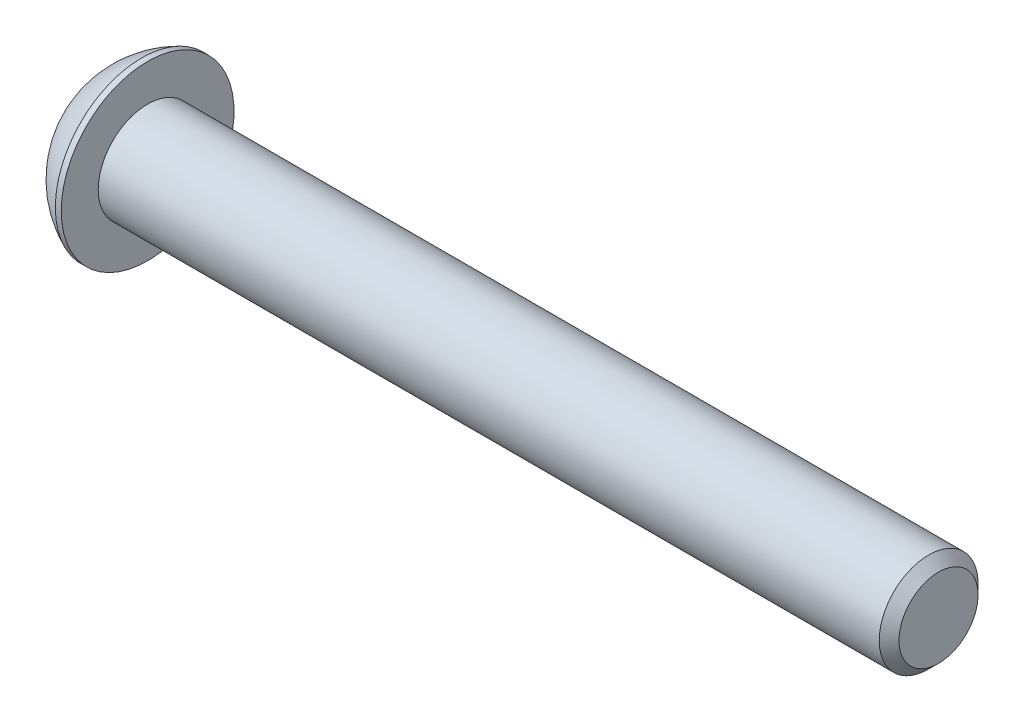
ISO-10303-21;
HEADER;
FILE_DESCRIPTION(('STEP AP214'),'2;1');
FILE_NAME('part.step','',(''),(''),'','','');
FILE_SCHEMA(('AUTOMOTIVE_DESIGN { 1 0 10303 214 1 1 1 1 }'));
ENDSEC;
DATA;
#1=APPLICATION_CONTEXT('core data for automotive mechanical design processes');
#2=APPLICATION_PROTOCOL_DEFINITION('international standard','automotive_design',2000,#1);
#3=PRODUCT_CONTEXT('',#1,'mechanical');
#4=PRODUCT('Part','Part','',(#3));
#5=PRODUCT_RELATED_PRODUCT_CATEGORY('part','',(#4));
#6=PRODUCT_DEFINITION_FORMATION('','',#4);
#7=PRODUCT_DEFINITION_CONTEXT('part definition',#1,'design');
#8=PRODUCT_DEFINITION('design','',#6,#7);
#9=PRODUCT_DEFINITION_SHAPE('','',#8);
#10=(LENGTH_UNIT() NAMED_UNIT(*) SI_UNIT(.MILLI.,.METRE.));
#11=(NAMED_UNIT(*) PLANE_ANGLE_UNIT() SI_UNIT($,.RADIAN.));
#12=(NAMED_UNIT(*) SI_UNIT($,.STERADIAN.) SOLID_ANGLE_UNIT());
#13=UNCERTAINTY_MEASURE_WITH_UNIT(LENGTH_MEASURE(1.E-05),#10,'distance_accuracy_value','');
#14=(GEOMETRIC_REPRESENTATION_CONTEXT(3) GLOBAL_UNCERTAINTY_ASSIGNED_CONTEXT((#13)) GLOBAL_UNIT_ASSIGNED_CONTEXT((#10,
#11,#12)) REPRESENTATION_CONTEXT('',''));
#15=CARTESIAN_POINT('',(0.,0.,0.));
#16=DIRECTION('',(0.,0.,1.));
#17=DIRECTION('',(1.,0.,0.));
#18=AXIS2_PLACEMENT_3D('',#15,#16,#17);
#19=CARTESIAN_POINT('',(1.32080000000034,0.,0.));
#20=DIRECTION('',(-1.,0.,0.));
#21=DIRECTION('',(0.,0.,1.));
#22=AXIS2_PLACEMENT_3D('',#19,#20,#21);
#23=CONICAL_SURFACE('',#22,1.1937999999998,1.04719755119608);
#24=CARTESIAN_POINT('',(2.01004075135902,0.,-4.44089209850063E-13));
#25=VERTEX_POINT('',#24);
#26=VERTEX_LOOP('',#25);
#27=FACE_BOUND('',#26,.T.);
#28=CARTESIAN_POINT('',(1.32080000000009,0.,0.));
#29=DIRECTION('',(-1.,0.,0.));
#30=DIRECTION('',(0.,0.,1.));
#31=AXIS2_PLACEMENT_3D('',#28,#29,#30);
#32=CIRCLE('',#31,1.19380000000024);
#33=CARTESIAN_POINT('',(1.32080000000009,0.,1.19380000000024));
#34=VERTEX_POINT('',#33);
#35=EDGE_CURVE('E18',#34,#34,#32,.T.);
#36=ORIENTED_EDGE('',*,*,#35,.T.);
#37=EDGE_LOOP('',(#36));
#38=FACE_BOUND('',#37,.T.);
#39=ADVANCED_FACE('F15',(#27,#38),#23,.F.);
#40=CARTESIAN_POINT('',(1.3208,-2.29135888084633,0.));
#41=DIRECTION('',(1.,0.,0.));
#42=DIRECTION('',(0.,0.,-1.));
#43=AXIS2_PLACEMENT_3D('',#40,#41,#42);
#44=PLANE('',#43);
#45=DIRECTION('',(0.,1.,0.));
#46=VECTOR('',#45,1.);
#47=CARTESIAN_POINT('',(1.3208,-1.14567944042316,1.984375));
#48=LINE('',#47,#46);
#49=CARTESIAN_POINT('',(1.3208,1.14567944042316,1.984375));
#50=VERTEX_POINT('',#49);
#51=CARTESIAN_POINT('',(1.3208,-1.14567944042316,1.984375));
#52=VERTEX_POINT('',#51);
#53=EDGE_CURVE('E67',#50,#52,#48,.F.);
#54=ORIENTED_EDGE('',*,*,#53,.F.);
#55=DIRECTION('',(0.,0.5,-0.866025403784439));
#56=VECTOR('',#55,1.);
#57=CARTESIAN_POINT('',(1.3208,1.14567944042316,1.984375));
#58=LINE('',#57,#56);
#59=CARTESIAN_POINT('',(1.3208,2.29135888084633,0.));
#60=VERTEX_POINT('',#59);
#61=EDGE_CURVE('E290',#60,#50,#58,.F.);
#62=ORIENTED_EDGE('',*,*,#61,.F.);
#63=DIRECTION('',(0.,-0.5,-0.866025403784439));
#64=VECTOR('',#63,1.);
#65=CARTESIAN_POINT('',(1.3208,2.29135888084633,0.));
#66=LINE('',#65,#64);
#67=CARTESIAN_POINT('',(1.3208,1.14567944042316,-1.984375));
#68=VERTEX_POINT('',#67);
#69=EDGE_CURVE('E294',#68,#60,#66,.F.);
#70=ORIENTED_EDGE('',*,*,#69,.F.);
#71=DIRECTION('',(0.,1.,0.));
#72=VECTOR('',#71,1.);
#73=CARTESIAN_POINT('',(1.3208,1.14567944042316,-1.984375));
#74=LINE('',#73,#72);
#75=CARTESIAN_POINT('',(1.3208,-1.14567944042316,-1.984375));
#76=VERTEX_POINT('',#75);
#77=EDGE_CURVE('E299',#76,#68,#74,.T.);
#78=ORIENTED_EDGE('',*,*,#77,.F.);
#79=DIRECTION('',(0.,-0.500000000000001,0.866025403784438));
#80=VECTOR('',#79,1.);
#81=CARTESIAN_POINT('',(1.3208,-1.14567944042316,-1.984375));
#82=LINE('',#81,#80);
#83=CARTESIAN_POINT('',(1.3208,-2.29135888084633,0.));
#84=VERTEX_POINT('',#83);
#85=EDGE_CURVE('E304',#84,#76,#82,.F.);
#86=ORIENTED_EDGE('',*,*,#85,.F.);
#87=DIRECTION('',(0.,0.500000000000001,0.866025403784438));
#88=VECTOR('',#87,1.);
#89=CARTESIAN_POINT('',(1.3208,-2.29135888084633,0.));
#90=LINE('',#89,#88);
#91=EDGE_CURVE('E80',#52,#84,#90,.F.);
#92=ORIENTED_EDGE('',*,*,#91,.F.);
#93=EDGE_LOOP('',(#54,#62,#70,#78,#86,#92));
#94=FACE_BOUND('',#93,.T.);
#95=ORIENTED_EDGE('',*,*,#35,.F.);
#96=EDGE_LOOP('',(#95));
#97=FACE_BOUND('',#96,.T.);
#98=ADVANCED_FACE('F73',(#94,#97),#44,.F.);
#99=CARTESIAN_POINT('',(1.3208,-1.14567944042316,1.984375));
#100=DIRECTION('',(0.,0.,-1.));
#101=DIRECTION('',(0.,1.,0.));
#102=AXIS2_PLACEMENT_3D('',#99,#100,#101);
#103=PLANE('',#102);
#104=ORIENTED_EDGE('',*,*,#53,.T.);
#105=DIRECTION('',(1.,0.,0.));
#106=VECTOR('',#105,1.);
#107=CARTESIAN_POINT('',(1.3208,-1.14567944042316,1.984375));
#108=LINE('',#107,#106);
#109=CARTESIAN_POINT('',(0.,-1.14567944042316,1.984375));
#110=VERTEX_POINT('',#109);
#111=EDGE_CURVE('E77',#110,#52,#108,.T.);
#112=ORIENTED_EDGE('',*,*,#111,.F.);
#113=DIRECTION('',(0.,1.,0.));
#114=VECTOR('',#113,1.);
#115=CARTESIAN_POINT('',(0.,0.,1.984375));
#116=LINE('',#115,#114);
#117=CARTESIAN_POINT('',(0.,1.14567944042316,1.984375));
#118=VERTEX_POINT('',#117);
#119=EDGE_CURVE('E284',#118,#110,#116,.F.);
#120=ORIENTED_EDGE('',*,*,#119,.F.);
#121=DIRECTION('',(1.,0.,0.));
#122=VECTOR('',#121,1.);
#123=CARTESIAN_POINT('',(1.3208,1.14567944042316,1.984375));
#124=LINE('',#123,#122);
#125=EDGE_CURVE('E287',#50,#118,#124,.F.);
#126=ORIENTED_EDGE('',*,*,#125,.F.);
#127=EDGE_LOOP('',(#104,#112,#120,#126));
#128=FACE_BOUND('',#127,.T.);
#129=ADVANCED_FACE('F126',(#128),#103,.T.);
#130=CARTESIAN_POINT('',(1.3208,-2.29135888084633,0.));
#131=DIRECTION('',(0.,0.866025403784438,-0.500000000000001));
#132=DIRECTION('',(0.,0.500000000000001,0.866025403784438));
#133=AXIS2_PLACEMENT_3D('',#130,#131,#132);
#134=PLANE('',#133);
#135=ORIENTED_EDGE('',*,*,#91,.T.);
#136=DIRECTION('',(1.,0.,0.));
#137=VECTOR('',#136,1.);
#138=CARTESIAN_POINT('',(1.3208,-2.29135888084633,0.));
#139=LINE('',#138,#137);
#140=CARTESIAN_POINT('',(0.,-2.29135888084633,0.));
#141=VERTEX_POINT('',#140);
#142=EDGE_CURVE('E306',#141,#84,#139,.T.);
#143=ORIENTED_EDGE('',*,*,#142,.F.);
#144=DIRECTION('',(0.,-0.500000000000001,-0.866025403784438));
#145=VECTOR('',#144,1.);
#146=CARTESIAN_POINT('',(0.,-1.14567944042316,1.984375));
#147=LINE('',#146,#145);
#148=EDGE_CURVE('E281',#110,#141,#147,.T.);
#149=ORIENTED_EDGE('',*,*,#148,.F.);
#150=ORIENTED_EDGE('',*,*,#111,.T.);
#151=EDGE_LOOP('',(#135,#143,#149,#150));
#152=FACE_BOUND('',#151,.T.);
#153=ADVANCED_FACE('F122',(#152),#134,.T.);
#154=CARTESIAN_POINT('',(1.3208,-1.14567944042316,-1.984375));
#155=DIRECTION('',(0.,0.866025403784438,0.500000000000001));
#156=DIRECTION('',(0.,-0.500000000000001,0.866025403784438));
#157=AXIS2_PLACEMENT_3D('',#154,#155,#156);
#158=PLANE('',#157);
#159=ORIENTED_EDGE('',*,*,#85,.T.);
#160=DIRECTION('',(1.,0.,0.));
#161=VECTOR('',#160,1.);
#162=CARTESIAN_POINT('',(1.3208,-1.14567944042316,-1.984375));
#163=LINE('',#162,#161);
#164=CARTESIAN_POINT('',(0.,-1.14567944042316,-1.984375));
#165=VERTEX_POINT('',#164);
#166=EDGE_CURVE('E301',#165,#76,#163,.T.);
#167=ORIENTED_EDGE('',*,*,#166,.F.);
#168=DIRECTION('',(0.,0.500000000000001,-0.866025403784438));
#169=VECTOR('',#168,1.);
#170=CARTESIAN_POINT('',(0.,-2.29135888084633,0.));
#171=LINE('',#170,#169);
#172=EDGE_CURVE('E278',#141,#165,#171,.T.);
#173=ORIENTED_EDGE('',*,*,#172,.F.);
#174=ORIENTED_EDGE('',*,*,#142,.T.);
#175=EDGE_LOOP('',(#159,#167,#173,#174));
#176=FACE_BOUND('',#175,.T.);
#177=ADVANCED_FACE('F118',(#176),#158,.T.);
#178=CARTESIAN_POINT('',(1.3208,1.14567944042316,-1.984375));
#179=DIRECTION('',(0.,0.,1.));
#180=DIRECTION('',(1.,0.,0.));
#181=AXIS2_PLACEMENT_3D('',#178,#179,#180);
#182=PLANE('',#181);
#183=ORIENTED_EDGE('',*,*,#77,.T.);
#184=DIRECTION('',(1.,0.,0.));
#185=VECTOR('',#184,1.);
#186=CARTESIAN_POINT('',(1.3208,1.14567944042316,-1.984375));
#187=LINE('',#186,#185);
#188=CARTESIAN_POINT('',(0.,1.14567944042316,-1.984375));
#189=VERTEX_POINT('',#188);
#190=EDGE_CURVE('E296',#189,#68,#187,.T.);
#191=ORIENTED_EDGE('',*,*,#190,.F.);
#192=DIRECTION('',(0.,1.,0.));
#193=VECTOR('',#192,1.);
#194=CARTESIAN_POINT('',(0.,0.,-1.984375));
#195=LINE('',#194,#193);
#196=EDGE_CURVE('E275',#165,#189,#195,.T.);
#197=ORIENTED_EDGE('',*,*,#196,.F.);
#198=ORIENTED_EDGE('',*,*,#166,.T.);
#199=EDGE_LOOP('',(#183,#191,#197,#198));
#200=FACE_BOUND('',#199,.T.);
#201=ADVANCED_FACE('F115',(#200),#182,.T.);
#202=CARTESIAN_POINT('',(1.3208,2.29135888084633,0.));
#203=DIRECTION('',(0.,-0.866025403784439,0.5));
#204=DIRECTION('',(0.,-0.5,-0.866025403784439));
#205=AXIS2_PLACEMENT_3D('',#202,#203,#204);
#206=PLANE('',#205);
#207=ORIENTED_EDGE('',*,*,#69,.T.);
#208=DIRECTION('',(1.,0.,0.));
#209=VECTOR('',#208,1.);
#210=CARTESIAN_POINT('',(1.3208,2.29135888084633,0.));
#211=LINE('',#210,#209);
#212=CARTESIAN_POINT('',(0.,2.29135888084633,0.));
#213=VERTEX_POINT('',#212);
#214=EDGE_CURVE('E33',#213,#60,#211,.T.);
#215=ORIENTED_EDGE('',*,*,#214,.F.);
#216=DIRECTION('',(0.,0.5,0.866025403784439));
#217=VECTOR('',#216,1.);
#218=CARTESIAN_POINT('',(0.,1.14567944042316,-1.984375));
#219=LINE('',#218,#217);
#220=EDGE_CURVE('E272',#189,#213,#219,.T.);
#221=ORIENTED_EDGE('',*,*,#220,.F.);
#222=ORIENTED_EDGE('',*,*,#190,.T.);
#223=EDGE_LOOP('',(#207,#215,#221,#222));
#224=FACE_BOUND('',#223,.T.);
#225=ADVANCED_FACE('F111',(#224),#206,.T.);
#226=CARTESIAN_POINT('',(1.3208,1.14567944042316,1.984375));
#227=DIRECTION('',(0.,-0.866025403784439,-0.5));
#228=DIRECTION('',(0.,0.5,-0.866025403784439));
#229=AXIS2_PLACEMENT_3D('',#226,#227,#228);
#230=PLANE('',#229);
#231=ORIENTED_EDGE('',*,*,#61,.T.);
#232=ORIENTED_EDGE('',*,*,#125,.T.);
#233=DIRECTION('',(0.,-0.5,0.866025403784438));
#234=VECTOR('',#233,1.);
#235=CARTESIAN_POINT('',(0.,2.29135888084633,0.));
#236=LINE('',#235,#234);
#237=EDGE_CURVE('E98',#213,#118,#236,.T.);
#238=ORIENTED_EDGE('',*,*,#237,.F.);
#239=ORIENTED_EDGE('',*,*,#214,.T.);
#240=EDGE_LOOP('',(#231,#232,#238,#239));
#241=FACE_BOUND('',#240,.T.);
#242=ADVANCED_FACE('F107',(#241),#230,.T.);
#243=CARTESIAN_POINT('',(0.,0.,0.));
#244=DIRECTION('',(-1.,0.,0.));
#245=DIRECTION('',(0.,0.,1.));
#246=AXIS2_PLACEMENT_3D('',#243,#244,#245);
#247=PLANE('',#246);
#248=ORIENTED_EDGE('',*,*,#220,.T.);
#249=ORIENTED_EDGE('',*,*,#237,.T.);
#250=ORIENTED_EDGE('',*,*,#119,.T.);
#251=ORIENTED_EDGE('',*,*,#148,.T.);
#252=ORIENTED_EDGE('',*,*,#172,.T.);
#253=ORIENTED_EDGE('',*,*,#196,.T.);
#254=EDGE_LOOP('',(#248,#249,#250,#251,#252,#253));
#255=FACE_BOUND('',#254,.T.);
#256=CARTESIAN_POINT('',(0.,2.77495,0.));
#257=CARTESIAN_POINT('',(0.,2.77494953309947,0.077911893752346));
#258=CARTESIAN_POINT('',(0.,2.77166578388025,0.15583810591977));
#259=CARTESIAN_POINT('',(0.,2.75855213600204,0.311152012455904));
#260=CARTESIAN_POINT('',(0.,2.74872030471467,0.388539541019556));
#261=CARTESIAN_POINT('',(0.,2.72255472645677,0.542341518735718));
#262=CARTESIAN_POINT('',(-2.70111753942276E-13,2.70621065843662,0.618754223567578));
#263=CARTESIAN_POINT('',(2.71199122712048E-13,2.66713326915777,0.769973634286023));
#264=CARTESIAN_POINT('',(1.01140160355389E-12,2.64439476297869,0.844778983646282));
#265=CARTESIAN_POINT('',(1.81659311492368E-12,2.5669019594335,1.06566239301792));
#266=CARTESIAN_POINT('',(4.76424972847466E-13,2.50280672569928,1.20857954243987));
#267=CARTESIAN_POINT('',(-4.75575707467107E-13,2.35149826934097,1.48160874561538));
#268=CARTESIAN_POINT('',(0.,2.26428416790396,1.61172031233499));
#269=CARTESIAN_POINT('',(0.,2.1181093928834,1.79445660654268));
#270=CARTESIAN_POINT('',(0.,2.06678693791626,1.85333128513997));
#271=CARTESIAN_POINT('',(0.,1.95940522984449,1.96650727912792));
#272=CARTESIAN_POINT('',(0.,1.90335059143535,2.02081294920044));
#273=CARTESIAN_POINT('',(0.,1.78683891013963,2.12453280878582));
#274=CARTESIAN_POINT('',(0.,1.72637988450322,2.1739447713554));
#275=CARTESIAN_POINT('',(0.,1.6015196886571,2.26750481692908));
#276=CARTESIAN_POINT('',(0.,1.53711760864537,2.31165167810848));
#277=CARTESIAN_POINT('',(0.,1.33869902291632,2.43567242603945));
#278=CARTESIAN_POINT('',(0.,1.19934704110695,2.507235886628));
#279=CARTESIAN_POINT('',(0.,0.910681609121876,2.62590828672821));
#280=CARTESIAN_POINT('',(0.,0.761368265357393,2.67301748742279));
#281=CARTESIAN_POINT('',(0.,0.456932649466618,2.74151230664007));
#282=CARTESIAN_POINT('',(0.,0.301810346322579,2.76289778778721));
#283=CARTESIAN_POINT('',(0.,-0.00982263870895675,2.77931595661156));
#284=CARTESIAN_POINT('',(0.,-0.166333320596453,2.77434864428877));
#285=CARTESIAN_POINT('',(0.,-0.476280836814457,2.73822217653073));
#286=CARTESIAN_POINT('',(0.,-0.62971768755599,2.70706316096981));
#287=CARTESIAN_POINT('',(0.,-0.92925483004428,2.6193798077115));
#288=CARTESIAN_POINT('',(0.,-1.0753550434132,2.56285519909569));
#289=CARTESIAN_POINT('',(0.,-1.2857069259858,2.46037024128109));
#290=CARTESIAN_POINT('',(0.,-1.35439130022287,2.42323494812897));
#291=CARTESIAN_POINT('',(0.,-1.488391287199,2.34331277270256));
#292=CARTESIAN_POINT('',(0.,-1.55370767631788,2.30052720108832));
#293=CARTESIAN_POINT('',(0.,-1.68047292776595,2.20962421887055));
#294=CARTESIAN_POINT('',(0.,-1.74192352786821,2.16150923122349));
#295=CARTESIAN_POINT('',(0.,-1.86060297067993,2.06024311301283));
#296=CARTESIAN_POINT('',(0.,-1.91782768181716,2.00708716697631));
#297=CARTESIAN_POINT('',(0.,-2.08239462196652,1.84072208565541));
#298=CARTESIAN_POINT('',(0.,-2.18279764272602,1.72049499758422));
#299=CARTESIAN_POINT('',(0.,-2.36195754944064,1.46487629213019));
#300=CARTESIAN_POINT('',(0.,-2.44071525816758,1.32948525142808));
#301=CARTESIAN_POINT('',(0.,-2.54098882695274,1.11796734074395));
#302=CARTESIAN_POINT('',(0.,-2.57146177392728,1.04596540008348));
#303=CARTESIAN_POINT('',(0.,-2.62621251109,0.899689259475769));
#304=CARTESIAN_POINT('',(0.,-2.65049531495564,0.825416953360957));
#305=CARTESIAN_POINT('',(0.,-2.69267708798767,0.675215808695211));
#306=CARTESIAN_POINT('',(0.,-2.71058613777938,0.599289789313095));
#307=CARTESIAN_POINT('',(0.,-2.73994710360128,0.446213628496935));
#308=CARTESIAN_POINT('',(0.,-2.75140092413872,0.369063855024791));
#309=CARTESIAN_POINT('',(0.,-2.76470470685523,0.243162088173433));
#310=CARTESIAN_POINT('',(0.,-2.76854547596619,0.194611672428578));
#311=CARTESIAN_POINT('',(0.,-2.77366826843265,0.0973760351839821));
#312=CARTESIAN_POINT('',(0.,-2.77495029178815,0.04869081368424));
#313=CARTESIAN_POINT('',(0.,-2.77494953309948,-0.0779118937523475));
#314=CARTESIAN_POINT('',(0.,-2.77166578388026,-0.155838105919772));
#315=CARTESIAN_POINT('',(0.,-2.75855213600205,-0.311152012455906));
#316=CARTESIAN_POINT('',(0.,-2.74872030471469,-0.388539541019559));
#317=CARTESIAN_POINT('',(0.,-2.72255472645678,-0.54234151873572));
#318=CARTESIAN_POINT('',(-2.70430332641578E-13,-2.70621065843664,-0.61875422356758));
#319=CARTESIAN_POINT('',(2.71517960478941E-13,-2.66713326915778,-0.769973634286026));
#320=CARTESIAN_POINT('',(1.01275560390505E-12,-2.6443947629787,-0.844778983646286));
#321=CARTESIAN_POINT('',(1.81908746978714E-12,-2.56690195943352,-1.06566239301793));
#322=CARTESIAN_POINT('',(4.77073664932017E-13,-2.5028067256993,-1.20857954243988));
#323=CARTESIAN_POINT('',(-4.76224424213799E-13,-2.35149826934098,-1.48160874561538));
#324=CARTESIAN_POINT('',(0.,-2.26428416790397,-1.61172031233499));
#325=CARTESIAN_POINT('',(0.,-2.11810939288341,-1.79445660654268));
#326=CARTESIAN_POINT('',(0.,-2.06678693791627,-1.85333128513997));
#327=CARTESIAN_POINT('',(0.,-1.9594052298445,-1.96650727912792));
#328=CARTESIAN_POINT('',(0.,-1.90335059143536,-2.02081294920045));
#329=CARTESIAN_POINT('',(0.,-1.78683891013963,-2.12453280878582));
#330=CARTESIAN_POINT('',(0.,-1.72637988450323,-2.1739447713554));
#331=CARTESIAN_POINT('',(0.,-1.60151968865711,-2.26750481692909));
#332=CARTESIAN_POINT('',(0.,-1.53711760864538,-2.31165167810848));
#333=CARTESIAN_POINT('',(0.,-1.33869902291632,-2.43567242603945));
#334=CARTESIAN_POINT('',(0.,-1.19934704110696,-2.50723588662801));
#335=CARTESIAN_POINT('',(0.,-0.910681609121886,-2.62590828672822));
#336=CARTESIAN_POINT('',(0.,-0.761368265357404,-2.67301748742279));
#337=CARTESIAN_POINT('',(0.,-0.456932649466629,-2.74151230664008));
#338=CARTESIAN_POINT('',(0.,-0.301810346322589,-2.76289778778721));
#339=CARTESIAN_POINT('',(0.,0.00982263870894727,-2.77931595661156));
#340=CARTESIAN_POINT('',(0.,0.166333320596444,-2.77434864428877));
#341=CARTESIAN_POINT('',(0.,0.476280836814448,-2.73822217653073));
#342=CARTESIAN_POINT('',(0.,0.629717687555981,-2.70706316096981));
#343=CARTESIAN_POINT('',(0.,0.929254830044271,-2.6193798077115));
#344=CARTESIAN_POINT('',(0.,1.07535504341319,-2.56285519909569));
#345=CARTESIAN_POINT('',(0.,1.28570692598579,-2.46037024128109));
#346=CARTESIAN_POINT('',(0.,1.35439130022286,-2.42323494812896));
#347=CARTESIAN_POINT('',(0.,1.48839128719899,-2.34331277270256));
#348=CARTESIAN_POINT('',(0.,1.55370767631787,-2.30052720108832));
#349=CARTESIAN_POINT('',(0.,1.68047292776594,-2.20962421887055));
#350=CARTESIAN_POINT('',(0.,1.7419235278682,-2.16150923122349));
#351=CARTESIAN_POINT('',(0.,1.86060297067992,-2.06024311301283));
#352=CARTESIAN_POINT('',(0.,1.91782768181715,-2.0070871669763));
#353=CARTESIAN_POINT('',(0.,2.08239462196651,-1.8407220856554));
#354=CARTESIAN_POINT('',(0.,2.18279764272601,-1.72049499758422));
#355=CARTESIAN_POINT('',(0.,2.36195754944063,-1.46487629213018));
#356=CARTESIAN_POINT('',(0.,2.44071525816758,-1.32948525142808));
#357=CARTESIAN_POINT('',(0.,2.54098882695274,-1.11796734074395));
#358=CARTESIAN_POINT('',(0.,2.57146177392727,-1.04596540008348));
#359=CARTESIAN_POINT('',(0.,2.62621251108998,-0.899689259475768));
#360=CARTESIAN_POINT('',(0.,2.65049531495563,-0.825416953360956));
#361=CARTESIAN_POINT('',(0.,2.69267708798766,-0.675215808695209));
#362=CARTESIAN_POINT('',(0.,2.71058613777937,-0.599289789313094));
#363=CARTESIAN_POINT('',(0.,2.73994710360127,-0.446213628496932));
#364=CARTESIAN_POINT('',(0.,2.7514009241387,-0.369063855024788));
#365=CARTESIAN_POINT('',(0.,2.76470470685522,-0.24316208817343));
#366=CARTESIAN_POINT('',(0.,2.76854547596618,-0.194611672428577));
#367=CARTESIAN_POINT('',(0.,2.77366826843264,-0.0973760351839818));
#368=CARTESIAN_POINT('',(0.,2.77495029178814,-0.0486908136842405));
#369=CARTESIAN_POINT('',(0.,2.77495,0.));
#370=B_SPLINE_CURVE_WITH_KNOTS('',3,(#256,#257,#258,#259,#260,#261,#262,#263,#264,#265,#266,
#267,#268,#269,#270,#271,#272,#273,#274,#275,#276,#277,#278,#279,#280,#281,#282,#283,#284,#285,
#286,#287,#288,#289,#290,#291,#292,#293,#294,#295,#296,#297,#298,#299,#300,#301,#302,#303,#304,
#305,#306,#307,#308,#309,#310,#311,#312,#313,#314,#315,#316,#317,#318,#319,#320,#321,#322,#323,
#324,#325,#326,#327,#328,#329,#330,#331,#332,#333,#334,#335,#336,#337,#338,#339,#340,#341,#342,
#343,#344,#345,#346,#347,#348,#349,#350,#351,#352,#353,#354,#355,#356,#357,#358,#359,#360,#361,
#362,#363,#364,#365,#366,#367,#368,#369),.UNSPECIFIED.,.T.,.F.,(4,2,2,2,2,2,2,2,2,2,2,2,2,2,2,2,
2,2,2,2,2,2,2,2,2,2,2,2,2,2,2,2,2,2,2,2,2,2,2,2,2,2,2,2,2,2,2,2,2,2,2,2,2,2,2,2,4),(0.,
0.233690856748163,0.467450716578751,0.701582538521472,0.935904756015416,1.40343220467667,
1.87097742791502,2.10505636898837,2.33890962270652,2.57286880998746,2.80688218486307,
3.27442101763127,3.74195485676358,4.2094911927139,4.67702752866418,5.14456136779642,
5.61210020056469,5.84611357544034,6.08007276272137,6.3139260164395,6.54800495751273,
7.01555018075072,7.48307762941213,7.71739984690653,7.95153166884956,8.18529152868023,
8.41898238542856,8.56502681353349,8.71107124163844,8.9447620983866,9.17852195821719,
9.41265378015991,9.64697599765386,10.1145034463151,10.5820486695535,10.8161276106268,
11.049980864345,11.2839400516259,11.5179534265015,11.9854922592697,12.453026098402,
12.9205624343523,13.3880987703026,13.8556326094349,14.3231714422031,14.5571848170788,
14.7911440043598,15.0249972580779,15.2590761991512,15.7266214223892,16.1941488710506,
16.428471088545,16.662602910488,16.8963627703187,17.130053627067,17.2760980551719,
17.4221424832769),.UNSPECIFIED.);
#371=CARTESIAN_POINT('',(0.,2.77495,0.));
#372=VERTEX_POINT('',#371);
#373=EDGE_CURVE('E92',#372,#372,#370,.T.);
#374=ORIENTED_EDGE('',*,*,#373,.F.);
#375=EDGE_LOOP('',(#374));
#376=FACE_BOUND('',#375,.T.);
#377=ADVANCED_FACE('F103',(#255,#376),#247,.T.);
#378=CARTESIAN_POINT('',(5.37260881410257,0.,0.));
#379=DIRECTION('',(0.,1.,0.));
#380=DIRECTION('',(1.,0.,0.));
#381=AXIS2_PLACEMENT_3D('',#378,#379,#380);
#382=SPHERICAL_SURFACE('',#381,6.04692260343);
#383=CARTESIAN_POINT('',(2.9718,0.,0.));
#384=DIRECTION('',(-1.,0.,0.));
#385=DIRECTION('',(0.,0.,1.));
#386=AXIS2_PLACEMENT_3D('',#383,#384,#385);
#387=CIRCLE('',#386,5.5499);
#388=CARTESIAN_POINT('',(2.9718,0.,5.5499));
#389=VERTEX_POINT('',#388);
#390=EDGE_CURVE('E90',#389,#389,#387,.F.);
#391=ORIENTED_EDGE('',*,*,#390,.F.);
#392=EDGE_LOOP('',(#391));
#393=FACE_BOUND('',#392,.T.);
#394=ORIENTED_EDGE('',*,*,#373,.T.);
#395=EDGE_LOOP('',(#394));
#396=FACE_BOUND('',#395,.T.);
#397=ADVANCED_FACE('F99',(#393,#396),#382,.T.);
#398=CARTESIAN_POINT('',(54.1528,0.,0.));
#399=DIRECTION('',(-1.,0.,0.));
#400=DIRECTION('',(0.,0.,1.));
#401=AXIS2_PLACEMENT_3D('',#398,#399,#400);
#402=PLANE('',#401);
#403=CARTESIAN_POINT('',(54.1527999999971,0.,0.));
#404=DIRECTION('',(-1.,0.,0.));
#405=DIRECTION('',(0.,0.,1.));
#406=AXIS2_PLACEMENT_3D('',#403,#404,#405);
#407=CIRCLE('',#406,2.54000000006727);
#408=CARTESIAN_POINT('',(54.1527999999971,0.,2.54000000006727));
#409=VERTEX_POINT('',#408);
#410=EDGE_CURVE('E87',#409,#409,#407,.T.);
#411=ORIENTED_EDGE('',*,*,#410,.F.);
#412=EDGE_LOOP('',(#411));
#413=FACE_BOUND('',#412,.T.);
#414=ADVANCED_FACE('F152',(#413),#402,.F.);
#415=CARTESIAN_POINT('',(0.,0.,0.));
#416=DIRECTION('',(-1.,0.,0.));
#417=DIRECTION('',(0.,0.,1.));
#418=AXIS2_PLACEMENT_3D('',#415,#416,#417);
#419=CYLINDRICAL_SURFACE('',#418,5.5499);
#420=ORIENTED_EDGE('',*,*,#390,.T.);
#421=EDGE_LOOP('',(#420));
#422=FACE_BOUND('',#421,.T.);
#423=CARTESIAN_POINT('',(3.3528,0.,0.));
#424=DIRECTION('',(-1.,0.,0.));
#425=DIRECTION('',(0.,0.,1.));
#426=AXIS2_PLACEMENT_3D('',#423,#424,#425);
#427=CIRCLE('',#426,5.5499);
#428=CARTESIAN_POINT('',(3.3528,0.,5.5499));
#429=VERTEX_POINT('',#428);
#430=EDGE_CURVE('E84',#429,#429,#427,.T.);
#431=ORIENTED_EDGE('',*,*,#430,.T.);
#432=EDGE_LOOP('',(#431));
#433=FACE_BOUND('',#432,.T.);
#434=ADVANCED_FACE('F149',(#422,#433),#419,.T.);
#435=CARTESIAN_POINT('',(53.5178000000656,0.,0.));
#436=DIRECTION('',(-1.,0.,0.));
#437=DIRECTION('',(0.,0.,1.));
#438=AXIS2_PLACEMENT_3D('',#435,#436,#437);
#439=CONICAL_SURFACE('',#438,3.17499999999882,0.785398163397448);
#440=CARTESIAN_POINT('',(53.5178,0.,0.));
#441=DIRECTION('',(-1.,0.,0.));
#442=DIRECTION('',(0.,0.,1.));
#443=AXIS2_PLACEMENT_3D('',#440,#441,#442);
#444=CIRCLE('',#443,3.175);
#445=CARTESIAN_POINT('',(53.5178,0.,3.175));
#446=VERTEX_POINT('',#445);
#447=EDGE_CURVE('E24',#446,#446,#444,.T.);
#448=ORIENTED_EDGE('',*,*,#447,.F.);
#449=EDGE_LOOP('',(#448));
#450=FACE_BOUND('',#449,.T.);
#451=ORIENTED_EDGE('',*,*,#410,.T.);
#452=EDGE_LOOP('',(#451));
#453=FACE_BOUND('',#452,.T.);
#454=ADVANCED_FACE('F142',(#450,#453),#439,.T.);
#455=CARTESIAN_POINT('',(3.3528,3.17499999999999,0.));
#456=DIRECTION('',(-1.,0.,0.));
#457=DIRECTION('',(0.,0.,1.));
#458=AXIS2_PLACEMENT_3D('',#455,#456,#457);
#459=PLANE('',#458);
#460=CARTESIAN_POINT('',(3.3528,0.,0.));
#461=DIRECTION('',(-1.,0.,0.));
#462=DIRECTION('',(0.,0.,1.));
#463=AXIS2_PLACEMENT_3D('',#460,#461,#462);
#464=CIRCLE('',#463,3.175);
#465=CARTESIAN_POINT('',(3.3528,0.,3.175));
#466=VERTEX_POINT('',#465);
#467=EDGE_CURVE('E10',#466,#466,#464,.F.);
#468=ORIENTED_EDGE('',*,*,#467,.F.);
#469=EDGE_LOOP('',(#468));
#470=FACE_BOUND('',#469,.T.);
#471=ORIENTED_EDGE('',*,*,#430,.F.);
#472=EDGE_LOOP('',(#471));
#473=FACE_BOUND('',#472,.T.);
#474=ADVANCED_FACE('F136',(#470,#473),#459,.F.);
#475=CARTESIAN_POINT('',(0.,0.,0.));
#476=DIRECTION('',(-1.,0.,0.));
#477=DIRECTION('',(0.,0.,1.));
#478=AXIS2_PLACEMENT_3D('',#475,#476,#477);
#479=CYLINDRICAL_SURFACE('',#478,3.175);
#480=ORIENTED_EDGE('',*,*,#467,.T.);
#481=EDGE_LOOP('',(#480));
#482=FACE_BOUND('',#481,.T.);
#483=ORIENTED_EDGE('',*,*,#447,.T.);
#484=EDGE_LOOP('',(#483));
#485=FACE_BOUND('',#484,.T.);
#486=ADVANCED_FACE('F134',(#482,#485),#479,.T.);
#487=CLOSED_SHELL('',(#39,#98,#129,#153,#177,#201,#225,#242,#377,#397,#414,#434,#454,#474,#486));
#488=MANIFOLD_SOLID_BREP('B1',#487);
#489=ADVANCED_BREP_SHAPE_REPRESENTATION('',(#18,#488),#14);
#490=SHAPE_DEFINITION_REPRESENTATION(#9,#489);
ENDSEC;
END-ISO-10303-21;
